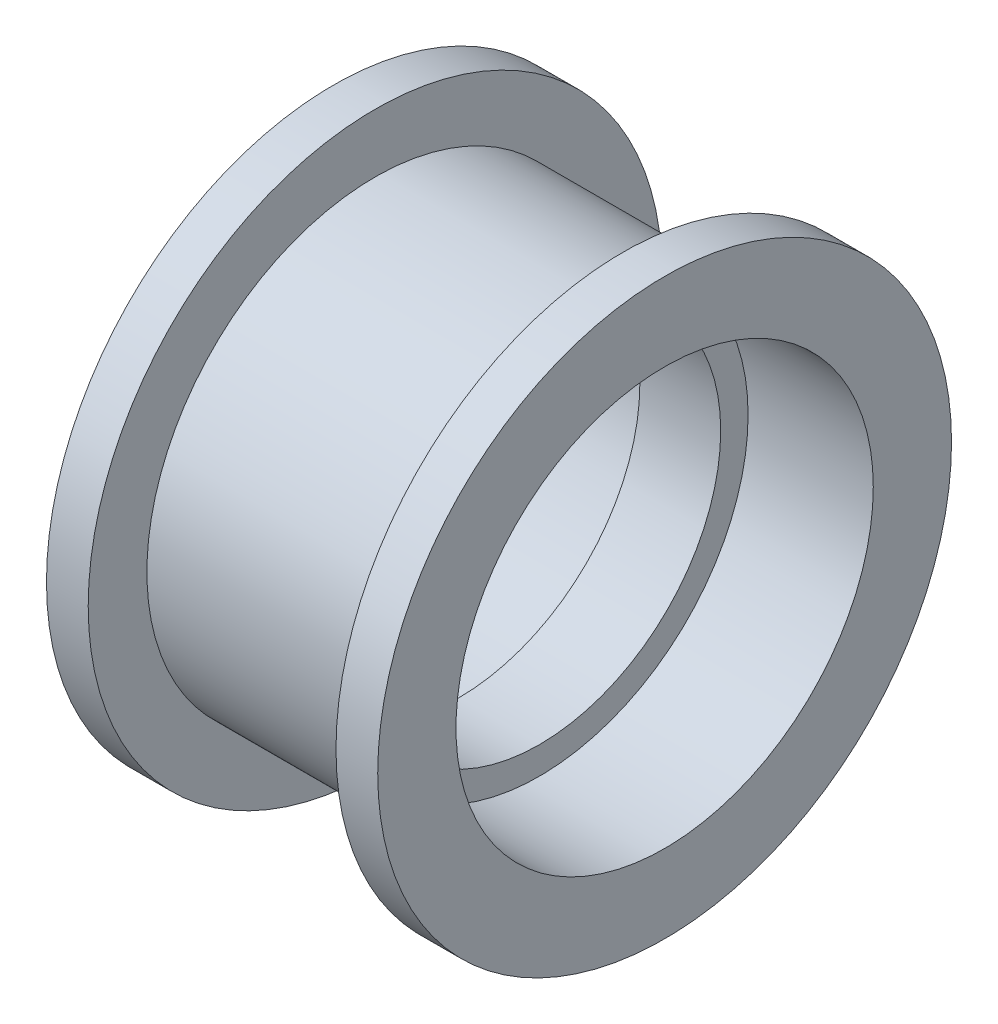
ISO-10303-21;
HEADER;
FILE_DESCRIPTION(('STEP AP214'),'2;1');
FILE_NAME('part.step','',(''),(''),'','','');
FILE_SCHEMA(('AUTOMOTIVE_DESIGN { 1 0 10303 214 1 1 1 1 }'));
ENDSEC;
DATA;
#1=APPLICATION_CONTEXT('core data for automotive mechanical design processes');
#2=APPLICATION_PROTOCOL_DEFINITION('international standard','automotive_design',2000,#1);
#3=PRODUCT_CONTEXT('',#1,'mechanical');
#4=PRODUCT('Part','Part','',(#3));
#5=PRODUCT_RELATED_PRODUCT_CATEGORY('part','',(#4));
#6=PRODUCT_DEFINITION_FORMATION('','',#4);
#7=PRODUCT_DEFINITION_CONTEXT('part definition',#1,'design');
#8=PRODUCT_DEFINITION('design','',#6,#7);
#9=PRODUCT_DEFINITION_SHAPE('','',#8);
#10=(LENGTH_UNIT() NAMED_UNIT(*) SI_UNIT(.MILLI.,.METRE.));
#11=(NAMED_UNIT(*) PLANE_ANGLE_UNIT() SI_UNIT($,.RADIAN.));
#12=(NAMED_UNIT(*) SI_UNIT($,.STERADIAN.) SOLID_ANGLE_UNIT());
#13=UNCERTAINTY_MEASURE_WITH_UNIT(LENGTH_MEASURE(1.E-05),#10,'distance_accuracy_value','');
#14=(GEOMETRIC_REPRESENTATION_CONTEXT(3) GLOBAL_UNCERTAINTY_ASSIGNED_CONTEXT((#13)) GLOBAL_UNIT_ASSIGNED_CONTEXT((#10,
#11,#12)) REPRESENTATION_CONTEXT('',''));
#15=CARTESIAN_POINT('',(0.,0.,0.));
#16=DIRECTION('',(0.,0.,1.));
#17=DIRECTION('',(1.,0.,0.));
#18=AXIS2_PLACEMENT_3D('',#15,#16,#17);
#19=CARTESIAN_POINT('',(-1.55,6.95,0.));
#20=DIRECTION('',(-1.,0.,0.));
#21=DIRECTION('',(0.,0.,1.));
#22=AXIS2_PLACEMENT_3D('',#19,#20,#21);
#23=PLANE('',#22);
#24=CARTESIAN_POINT('',(-1.55,0.,0.));
#25=DIRECTION('',(1.,0.,0.));
#26=DIRECTION('',(0.,0.,-1.));
#27=AXIS2_PLACEMENT_3D('',#24,#25,#26);
#28=CIRCLE('',#27,6.95);
#29=CARTESIAN_POINT('',(-1.55,0.,-6.95));
#30=VERTEX_POINT('',#29);
#31=EDGE_CURVE('E10',#30,#30,#28,.T.);
#32=ORIENTED_EDGE('',*,*,#31,.T.);
#33=EDGE_LOOP('',(#32));
#34=FACE_BOUND('',#33,.T.);
#35=CARTESIAN_POINT('',(-1.55,0.,0.));
#36=DIRECTION('',(1.,0.,0.));
#37=DIRECTION('',(0.,0.,-1.));
#38=AXIS2_PLACEMENT_3D('',#35,#36,#37);
#39=CIRCLE('',#38,8.);
#40=CARTESIAN_POINT('',(-1.55,0.,-8.));
#41=VERTEX_POINT('',#40);
#42=EDGE_CURVE('E77',#41,#41,#39,.T.);
#43=ORIENTED_EDGE('',*,*,#42,.F.);
#44=EDGE_LOOP('',(#43));
#45=FACE_BOUND('',#44,.T.);
#46=ADVANCED_FACE('F37',(#34,#45),#23,.T.);
#47=CARTESIAN_POINT('',(0.,0.,0.));
#48=DIRECTION('',(1.,0.,0.));
#49=DIRECTION('',(0.,0.,-1.));
#50=AXIS2_PLACEMENT_3D('',#47,#48,#49);
#51=CYLINDRICAL_SURFACE('',#50,6.95);
#52=CARTESIAN_POINT('',(1.55,0.,0.));
#53=DIRECTION('',(1.,0.,0.));
#54=DIRECTION('',(0.,0.,-1.));
#55=AXIS2_PLACEMENT_3D('',#52,#53,#54);
#56=CIRCLE('',#55,6.95);
#57=CARTESIAN_POINT('',(1.55,0.,-6.95));
#58=VERTEX_POINT('',#57);
#59=EDGE_CURVE('E43',#58,#58,#56,.T.);
#60=ORIENTED_EDGE('',*,*,#59,.T.);
#61=EDGE_LOOP('',(#60));
#62=FACE_BOUND('',#61,.T.);
#63=ORIENTED_EDGE('',*,*,#31,.F.);
#64=EDGE_LOOP('',(#63));
#65=FACE_BOUND('',#64,.T.);
#66=ADVANCED_FACE('F85',(#62,#65),#51,.F.);
#67=CARTESIAN_POINT('',(1.55,6.95,0.));
#68=DIRECTION('',(1.,0.,0.));
#69=DIRECTION('',(0.,0.,-1.));
#70=AXIS2_PLACEMENT_3D('',#67,#68,#69);
#71=PLANE('',#70);
#72=CARTESIAN_POINT('',(1.55,0.,0.));
#73=DIRECTION('',(1.,0.,0.));
#74=DIRECTION('',(0.,0.,-1.));
#75=AXIS2_PLACEMENT_3D('',#72,#73,#74);
#76=CIRCLE('',#75,8.);
#77=CARTESIAN_POINT('',(1.55,0.,-8.));
#78=VERTEX_POINT('',#77);
#79=EDGE_CURVE('E47',#78,#78,#76,.T.);
#80=ORIENTED_EDGE('',*,*,#79,.T.);
#81=EDGE_LOOP('',(#80));
#82=FACE_BOUND('',#81,.T.);
#83=ORIENTED_EDGE('',*,*,#59,.F.);
#84=EDGE_LOOP('',(#83));
#85=FACE_BOUND('',#84,.T.);
#86=ADVANCED_FACE('F89',(#82,#85),#71,.T.);
#87=CARTESIAN_POINT('',(0.,0.,0.));
#88=DIRECTION('',(1.,0.,0.));
#89=DIRECTION('',(0.,0.,-1.));
#90=AXIS2_PLACEMENT_3D('',#87,#88,#89);
#91=CYLINDRICAL_SURFACE('',#90,8.);
#92=CARTESIAN_POINT('',(6.35,0.,0.));
#93=DIRECTION('',(1.,0.,0.));
#94=DIRECTION('',(0.,0.,-1.));
#95=AXIS2_PLACEMENT_3D('',#92,#93,#94);
#96=CIRCLE('',#95,8.);
#97=CARTESIAN_POINT('',(6.35,0.,-8.));
#98=VERTEX_POINT('',#97);
#99=EDGE_CURVE('E51',#98,#98,#96,.T.);
#100=ORIENTED_EDGE('',*,*,#99,.T.);
#101=EDGE_LOOP('',(#100));
#102=FACE_BOUND('',#101,.T.);
#103=ORIENTED_EDGE('',*,*,#79,.F.);
#104=EDGE_LOOP('',(#103));
#105=FACE_BOUND('',#104,.T.);
#106=ADVANCED_FACE('F93',(#102,#105),#91,.F.);
#107=CARTESIAN_POINT('',(6.35,8.,0.));
#108=DIRECTION('',(1.,0.,0.));
#109=DIRECTION('',(0.,0.,-1.));
#110=AXIS2_PLACEMENT_3D('',#107,#108,#109);
#111=PLANE('',#110);
#112=CARTESIAN_POINT('',(6.35,0.,0.));
#113=DIRECTION('',(1.,0.,0.));
#114=DIRECTION('',(0.,0.,-1.));
#115=AXIS2_PLACEMENT_3D('',#112,#113,#114);
#116=CIRCLE('',#115,11.);
#117=CARTESIAN_POINT('',(6.35,0.,-11.));
#118=VERTEX_POINT('',#117);
#119=EDGE_CURVE('E56',#118,#118,#116,.T.);
#120=ORIENTED_EDGE('',*,*,#119,.T.);
#121=EDGE_LOOP('',(#120));
#122=FACE_BOUND('',#121,.T.);
#123=ORIENTED_EDGE('',*,*,#99,.F.);
#124=EDGE_LOOP('',(#123));
#125=FACE_BOUND('',#124,.T.);
#126=ADVANCED_FACE('F100',(#122,#125),#111,.T.);
#127=CARTESIAN_POINT('',(0.,0.,0.));
#128=DIRECTION('',(1.,0.,0.));
#129=DIRECTION('',(0.,0.,-1.));
#130=AXIS2_PLACEMENT_3D('',#127,#128,#129);
#131=CYLINDRICAL_SURFACE('',#130,11.);
#132=CARTESIAN_POINT('',(4.75,0.,0.));
#133=DIRECTION('',(1.,0.,0.));
#134=DIRECTION('',(0.,0.,-1.));
#135=AXIS2_PLACEMENT_3D('',#132,#133,#134);
#136=CIRCLE('',#135,11.);
#137=CARTESIAN_POINT('',(4.75,0.,-11.));
#138=VERTEX_POINT('',#137);
#139=EDGE_CURVE('E59',#138,#138,#136,.T.);
#140=ORIENTED_EDGE('',*,*,#139,.T.);
#141=EDGE_LOOP('',(#140));
#142=FACE_BOUND('',#141,.T.);
#143=ORIENTED_EDGE('',*,*,#119,.F.);
#144=EDGE_LOOP('',(#143));
#145=FACE_BOUND('',#144,.T.);
#146=ADVANCED_FACE('F104',(#142,#145),#131,.T.);
#147=CARTESIAN_POINT('',(4.75,11.,0.));
#148=DIRECTION('',(-1.,0.,0.));
#149=DIRECTION('',(0.,0.,1.));
#150=AXIS2_PLACEMENT_3D('',#147,#148,#149);
#151=PLANE('',#150);
#152=CARTESIAN_POINT('',(4.75,0.,0.));
#153=DIRECTION('',(1.,0.,0.));
#154=DIRECTION('',(0.,0.,-1.));
#155=AXIS2_PLACEMENT_3D('',#152,#153,#154);
#156=CIRCLE('',#155,8.75);
#157=CARTESIAN_POINT('',(4.75,0.,-8.75));
#158=VERTEX_POINT('',#157);
#159=EDGE_CURVE('E62',#158,#158,#156,.T.);
#160=ORIENTED_EDGE('',*,*,#159,.T.);
#161=EDGE_LOOP('',(#160));
#162=FACE_BOUND('',#161,.T.);
#163=ORIENTED_EDGE('',*,*,#139,.F.);
#164=EDGE_LOOP('',(#163));
#165=FACE_BOUND('',#164,.T.);
#166=ADVANCED_FACE('F108',(#162,#165),#151,.T.);
#167=CARTESIAN_POINT('',(0.,0.,0.));
#168=DIRECTION('',(1.,0.,0.));
#169=DIRECTION('',(0.,0.,-1.));
#170=AXIS2_PLACEMENT_3D('',#167,#168,#169);
#171=CYLINDRICAL_SURFACE('',#170,8.75);
#172=CARTESIAN_POINT('',(-4.75,0.,0.));
#173=DIRECTION('',(1.,0.,0.));
#174=DIRECTION('',(0.,0.,-1.));
#175=AXIS2_PLACEMENT_3D('',#172,#173,#174);
#176=CIRCLE('',#175,8.75);
#177=CARTESIAN_POINT('',(-4.75,0.,-8.75));
#178=VERTEX_POINT('',#177);
#179=EDGE_CURVE('E65',#178,#178,#176,.T.);
#180=ORIENTED_EDGE('',*,*,#179,.T.);
#181=EDGE_LOOP('',(#180));
#182=FACE_BOUND('',#181,.T.);
#183=ORIENTED_EDGE('',*,*,#159,.F.);
#184=EDGE_LOOP('',(#183));
#185=FACE_BOUND('',#184,.T.);
#186=ADVANCED_FACE('F112',(#182,#185),#171,.T.);
#187=CARTESIAN_POINT('',(-4.75,11.,0.));
#188=DIRECTION('',(1.,0.,0.));
#189=DIRECTION('',(0.,0.,-1.));
#190=AXIS2_PLACEMENT_3D('',#187,#188,#189);
#191=PLANE('',#190);
#192=CARTESIAN_POINT('',(-4.75,0.,0.));
#193=DIRECTION('',(1.,0.,0.));
#194=DIRECTION('',(0.,0.,-1.));
#195=AXIS2_PLACEMENT_3D('',#192,#193,#194);
#196=CIRCLE('',#195,11.);
#197=CARTESIAN_POINT('',(-4.75,0.,-11.));
#198=VERTEX_POINT('',#197);
#199=EDGE_CURVE('E68',#198,#198,#196,.T.);
#200=ORIENTED_EDGE('',*,*,#199,.T.);
#201=EDGE_LOOP('',(#200));
#202=FACE_BOUND('',#201,.T.);
#203=ORIENTED_EDGE('',*,*,#179,.F.);
#204=EDGE_LOOP('',(#203));
#205=FACE_BOUND('',#204,.T.);
#206=ADVANCED_FACE('F116',(#202,#205),#191,.T.);
#207=CARTESIAN_POINT('',(0.,0.,0.));
#208=DIRECTION('',(1.,0.,0.));
#209=DIRECTION('',(0.,0.,-1.));
#210=AXIS2_PLACEMENT_3D('',#207,#208,#209);
#211=CYLINDRICAL_SURFACE('',#210,11.);
#212=CARTESIAN_POINT('',(-6.35,0.,0.));
#213=DIRECTION('',(1.,0.,0.));
#214=DIRECTION('',(0.,0.,-1.));
#215=AXIS2_PLACEMENT_3D('',#212,#213,#214);
#216=CIRCLE('',#215,11.);
#217=CARTESIAN_POINT('',(-6.35,0.,-11.));
#218=VERTEX_POINT('',#217);
#219=EDGE_CURVE('E71',#218,#218,#216,.T.);
#220=ORIENTED_EDGE('',*,*,#219,.T.);
#221=EDGE_LOOP('',(#220));
#222=FACE_BOUND('',#221,.T.);
#223=ORIENTED_EDGE('',*,*,#199,.F.);
#224=EDGE_LOOP('',(#223));
#225=FACE_BOUND('',#224,.T.);
#226=ADVANCED_FACE('F120',(#222,#225),#211,.T.);
#227=CARTESIAN_POINT('',(-6.35,8.,0.));
#228=DIRECTION('',(-1.,0.,0.));
#229=DIRECTION('',(0.,0.,1.));
#230=AXIS2_PLACEMENT_3D('',#227,#228,#229);
#231=PLANE('',#230);
#232=CARTESIAN_POINT('',(-6.35,0.,0.));
#233=DIRECTION('',(1.,0.,0.));
#234=DIRECTION('',(0.,0.,-1.));
#235=AXIS2_PLACEMENT_3D('',#232,#233,#234);
#236=CIRCLE('',#235,8.);
#237=CARTESIAN_POINT('',(-6.35,0.,-8.));
#238=VERTEX_POINT('',#237);
#239=EDGE_CURVE('E74',#238,#238,#236,.T.);
#240=ORIENTED_EDGE('',*,*,#239,.T.);
#241=EDGE_LOOP('',(#240));
#242=FACE_BOUND('',#241,.T.);
#243=ORIENTED_EDGE('',*,*,#219,.F.);
#244=EDGE_LOOP('',(#243));
#245=FACE_BOUND('',#244,.T.);
#246=ADVANCED_FACE('F124',(#242,#245),#231,.T.);
#247=CARTESIAN_POINT('',(0.,0.,0.));
#248=DIRECTION('',(1.,0.,0.));
#249=DIRECTION('',(0.,0.,-1.));
#250=AXIS2_PLACEMENT_3D('',#247,#248,#249);
#251=CYLINDRICAL_SURFACE('',#250,8.);
#252=ORIENTED_EDGE('',*,*,#42,.T.);
#253=EDGE_LOOP('',(#252));
#254=FACE_BOUND('',#253,.T.);
#255=ORIENTED_EDGE('',*,*,#239,.F.);
#256=EDGE_LOOP('',(#255));
#257=FACE_BOUND('',#256,.T.);
#258=ADVANCED_FACE('F81',(#254,#257),#251,.F.);
#259=CLOSED_SHELL('',(#46,#66,#86,#106,#126,#146,#166,#186,#206,#226,#246,#258));
#260=MANIFOLD_SOLID_BREP('B2',#259);
#261=ADVANCED_BREP_SHAPE_REPRESENTATION('',(#18,#260),#14);
#262=SHAPE_DEFINITION_REPRESENTATION(#9,#261);
ENDSEC;
END-ISO-10303-21;
